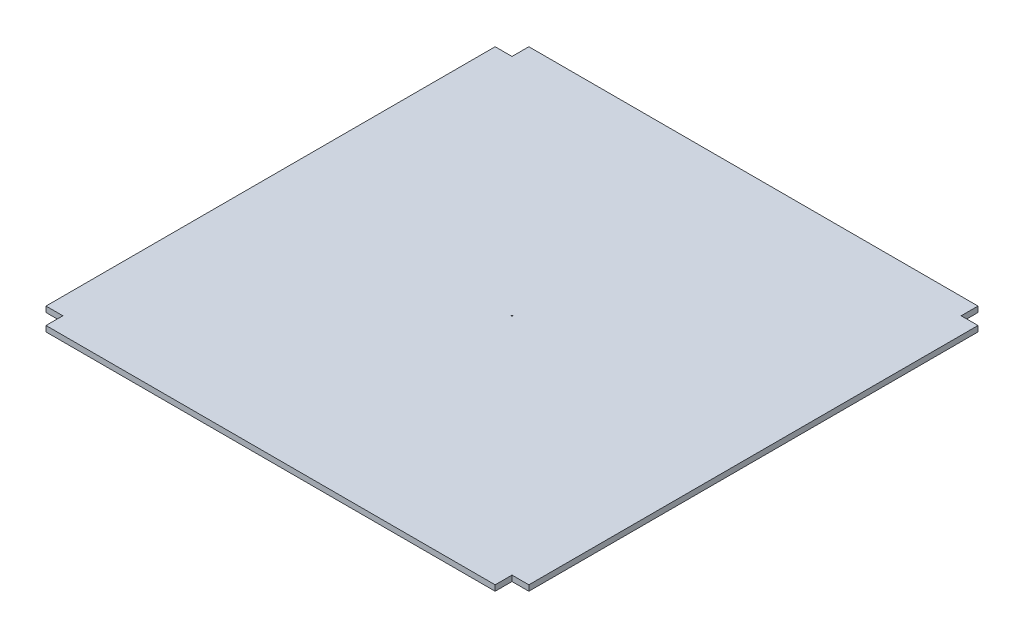
ISO-10303-21;
HEADER;
FILE_DESCRIPTION(('STEP AP214'),'2;1');
FILE_NAME('part.step','',(''),(''),'','','');
FILE_SCHEMA(('AUTOMOTIVE_DESIGN { 1 0 10303 214 1 1 1 1 }'));
ENDSEC;
DATA;
#1=APPLICATION_CONTEXT('core data for automotive mechanical design processes');
#2=APPLICATION_PROTOCOL_DEFINITION('international standard','automotive_design',2000,#1);
#3=PRODUCT_CONTEXT('',#1,'mechanical');
#4=PRODUCT('Part','Part','',(#3));
#5=PRODUCT_RELATED_PRODUCT_CATEGORY('part','',(#4));
#6=PRODUCT_DEFINITION_FORMATION('','',#4);
#7=PRODUCT_DEFINITION_CONTEXT('part definition',#1,'design');
#8=PRODUCT_DEFINITION('design','',#6,#7);
#9=PRODUCT_DEFINITION_SHAPE('','',#8);
#10=(LENGTH_UNIT() NAMED_UNIT(*) SI_UNIT(.MILLI.,.METRE.));
#11=(NAMED_UNIT(*) PLANE_ANGLE_UNIT() SI_UNIT($,.RADIAN.));
#12=(NAMED_UNIT(*) SI_UNIT($,.STERADIAN.) SOLID_ANGLE_UNIT());
#13=UNCERTAINTY_MEASURE_WITH_UNIT(LENGTH_MEASURE(1.E-05),#10,'distance_accuracy_value','');
#14=(GEOMETRIC_REPRESENTATION_CONTEXT(3) GLOBAL_UNCERTAINTY_ASSIGNED_CONTEXT((#13)) GLOBAL_UNIT_ASSIGNED_CONTEXT((#10,
#11,#12)) REPRESENTATION_CONTEXT('',''));
#15=CARTESIAN_POINT('',(0.,0.,0.));
#16=DIRECTION('',(0.,0.,1.));
#17=DIRECTION('',(1.,0.,0.));
#18=AXIS2_PLACEMENT_3D('',#15,#16,#17);
#19=CARTESIAN_POINT('',(0.,10.,430.));
#20=DIRECTION('',(0.,0.,-1.));
#21=DIRECTION('',(-1.,0.,0.));
#22=AXIS2_PLACEMENT_3D('',#19,#20,#21);
#23=PLANE('',#22);
#24=DIRECTION('',(1.,0.,0.));
#25=VECTOR('',#24,1.);
#26=CARTESIAN_POINT('',(0.,0.,430.));
#27=LINE('',#26,#25);
#28=CARTESIAN_POINT('',(-400.,0.,430.));
#29=VERTEX_POINT('',#28);
#30=CARTESIAN_POINT('',(400.,0.,430.));
#31=VERTEX_POINT('',#30);
#32=EDGE_CURVE('E165',#29,#31,#27,.T.);
#33=ORIENTED_EDGE('',*,*,#32,.T.);
#34=DIRECTION('',(0.,-1.,0.));
#35=VECTOR('',#34,1.);
#36=CARTESIAN_POINT('',(400.,10.,430.));
#37=LINE('',#36,#35);
#38=CARTESIAN_POINT('',(400.,10.,430.));
#39=VERTEX_POINT('',#38);
#40=EDGE_CURVE('E11',#39,#31,#37,.T.);
#41=ORIENTED_EDGE('',*,*,#40,.F.);
#42=DIRECTION('',(1.,0.,0.));
#43=VECTOR('',#42,1.);
#44=CARTESIAN_POINT('',(0.,10.,430.));
#45=LINE('',#44,#43);
#46=CARTESIAN_POINT('',(-400.,10.,430.));
#47=VERTEX_POINT('',#46);
#48=EDGE_CURVE('E210',#47,#39,#45,.T.);
#49=ORIENTED_EDGE('',*,*,#48,.F.);
#50=DIRECTION('',(0.,-1.,0.));
#51=VECTOR('',#50,1.);
#52=CARTESIAN_POINT('',(-400.,10.,430.));
#53=LINE('',#52,#51);
#54=EDGE_CURVE('E57',#47,#29,#53,.T.);
#55=ORIENTED_EDGE('',*,*,#54,.T.);
#56=EDGE_LOOP('',(#33,#41,#49,#55));
#57=FACE_BOUND('',#56,.T.);
#58=ADVANCED_FACE('F40',(#57),#23,.F.);
#59=CARTESIAN_POINT('',(400.,10.,0.));
#60=DIRECTION('',(-1.,0.,0.));
#61=DIRECTION('',(0.,0.,1.));
#62=AXIS2_PLACEMENT_3D('',#59,#60,#61);
#63=PLANE('',#62);
#64=DIRECTION('',(0.,0.,-1.));
#65=VECTOR('',#64,1.);
#66=CARTESIAN_POINT('',(400.,0.,0.));
#67=LINE('',#66,#65);
#68=CARTESIAN_POINT('',(400.,0.,400.));
#69=VERTEX_POINT('',#68);
#70=EDGE_CURVE('E168',#31,#69,#67,.T.);
#71=ORIENTED_EDGE('',*,*,#70,.T.);
#72=DIRECTION('',(0.,-1.,0.));
#73=VECTOR('',#72,1.);
#74=CARTESIAN_POINT('',(400.,10.,400.));
#75=LINE('',#74,#73);
#76=CARTESIAN_POINT('',(400.,10.,400.));
#77=VERTEX_POINT('',#76);
#78=EDGE_CURVE('E49',#77,#69,#75,.T.);
#79=ORIENTED_EDGE('',*,*,#78,.F.);
#80=DIRECTION('',(0.,0.,-1.));
#81=VECTOR('',#80,1.);
#82=CARTESIAN_POINT('',(400.,10.,0.));
#83=LINE('',#82,#81);
#84=EDGE_CURVE('E108',#39,#77,#83,.T.);
#85=ORIENTED_EDGE('',*,*,#84,.F.);
#86=ORIENTED_EDGE('',*,*,#40,.T.);
#87=EDGE_LOOP('',(#71,#79,#85,#86));
#88=FACE_BOUND('',#87,.T.);
#89=ADVANCED_FACE('F241',(#88),#63,.F.);
#90=CARTESIAN_POINT('',(-1.48029736616687E-12,10.,399.999999999998));
#91=DIRECTION('',(0.,0.,1.));
#92=DIRECTION('',(1.,0.,0.));
#93=AXIS2_PLACEMENT_3D('',#90,#91,#92);
#94=PLANE('',#93);
#95=DIRECTION('',(-1.,0.,0.));
#96=VECTOR('',#95,1.);
#97=CARTESIAN_POINT('',(-1.48029736616687E-12,0.,399.999999999998));
#98=LINE('',#97,#96);
#99=CARTESIAN_POINT('',(430.,0.,400.));
#100=VERTEX_POINT('',#99);
#101=EDGE_CURVE('E173',#100,#69,#98,.T.);
#102=ORIENTED_EDGE('',*,*,#101,.F.);
#103=DIRECTION('',(0.,-1.,0.));
#104=VECTOR('',#103,1.);
#105=CARTESIAN_POINT('',(430.,10.,400.));
#106=LINE('',#105,#104);
#107=CARTESIAN_POINT('',(430.,10.,400.));
#108=VERTEX_POINT('',#107);
#109=EDGE_CURVE('E232',#108,#100,#106,.T.);
#110=ORIENTED_EDGE('',*,*,#109,.F.);
#111=DIRECTION('',(-1.,0.,0.));
#112=VECTOR('',#111,1.);
#113=CARTESIAN_POINT('',(-1.48029736616687E-12,10.,399.999999999998));
#114=LINE('',#113,#112);
#115=EDGE_CURVE('E240',#108,#77,#114,.T.);
#116=ORIENTED_EDGE('',*,*,#115,.T.);
#117=ORIENTED_EDGE('',*,*,#78,.T.);
#118=EDGE_LOOP('',(#102,#110,#116,#117));
#119=FACE_BOUND('',#118,.T.);
#120=ADVANCED_FACE('F238',(#119),#94,.T.);
#121=CARTESIAN_POINT('',(430.,10.,0.));
#122=DIRECTION('',(1.,0.,0.));
#123=DIRECTION('',(0.,0.,-1.));
#124=AXIS2_PLACEMENT_3D('',#121,#122,#123);
#125=PLANE('',#124);
#126=DIRECTION('',(0.,0.,1.));
#127=VECTOR('',#126,1.);
#128=CARTESIAN_POINT('',(430.,0.,0.));
#129=LINE('',#128,#127);
#130=CARTESIAN_POINT('',(430.,0.,-400.));
#131=VERTEX_POINT('',#130);
#132=EDGE_CURVE('E177',#131,#100,#129,.T.);
#133=ORIENTED_EDGE('',*,*,#132,.F.);
#134=DIRECTION('',(0.,-1.,0.));
#135=VECTOR('',#134,1.);
#136=CARTESIAN_POINT('',(430.,10.,-400.));
#137=LINE('',#136,#135);
#138=CARTESIAN_POINT('',(430.,10.,-400.));
#139=VERTEX_POINT('',#138);
#140=EDGE_CURVE('E229',#139,#131,#137,.T.);
#141=ORIENTED_EDGE('',*,*,#140,.F.);
#142=DIRECTION('',(0.,0.,1.));
#143=VECTOR('',#142,1.);
#144=CARTESIAN_POINT('',(430.,10.,0.));
#145=LINE('',#144,#143);
#146=EDGE_CURVE('E252',#139,#108,#145,.T.);
#147=ORIENTED_EDGE('',*,*,#146,.T.);
#148=ORIENTED_EDGE('',*,*,#109,.T.);
#149=EDGE_LOOP('',(#133,#141,#147,#148));
#150=FACE_BOUND('',#149,.T.);
#151=ADVANCED_FACE('F248',(#150),#125,.T.);
#152=CARTESIAN_POINT('',(-1.48029736616687E-12,10.,-399.999999999998));
#153=DIRECTION('',(0.,0.,1.));
#154=DIRECTION('',(1.,0.,0.));
#155=AXIS2_PLACEMENT_3D('',#152,#153,#154);
#156=PLANE('',#155);
#157=DIRECTION('',(-1.,0.,0.));
#158=VECTOR('',#157,1.);
#159=CARTESIAN_POINT('',(-1.48029736616687E-12,0.,-399.999999999998));
#160=LINE('',#159,#158);
#161=CARTESIAN_POINT('',(400.,0.,-400.));
#162=VERTEX_POINT('',#161);
#163=EDGE_CURVE('E181',#131,#162,#160,.T.);
#164=ORIENTED_EDGE('',*,*,#163,.T.);
#165=DIRECTION('',(0.,-1.,0.));
#166=VECTOR('',#165,1.);
#167=CARTESIAN_POINT('',(400.,10.,-400.));
#168=LINE('',#167,#166);
#169=CARTESIAN_POINT('',(400.,10.,-400.));
#170=VERTEX_POINT('',#169);
#171=EDGE_CURVE('E226',#170,#162,#168,.T.);
#172=ORIENTED_EDGE('',*,*,#171,.F.);
#173=DIRECTION('',(-1.,0.,0.));
#174=VECTOR('',#173,1.);
#175=CARTESIAN_POINT('',(-1.48029736616687E-12,10.,-399.999999999998));
#176=LINE('',#175,#174);
#177=EDGE_CURVE('E257',#139,#170,#176,.T.);
#178=ORIENTED_EDGE('',*,*,#177,.F.);
#179=ORIENTED_EDGE('',*,*,#140,.T.);
#180=EDGE_LOOP('',(#164,#172,#178,#179));
#181=FACE_BOUND('',#180,.T.);
#182=ADVANCED_FACE('F378',(#181),#156,.F.);
#183=CARTESIAN_POINT('',(400.,10.,0.));
#184=DIRECTION('',(1.,0.,0.));
#185=DIRECTION('',(0.,0.,-1.));
#186=AXIS2_PLACEMENT_3D('',#183,#184,#185);
#187=PLANE('',#186);
#188=DIRECTION('',(0.,0.,1.));
#189=VECTOR('',#188,1.);
#190=CARTESIAN_POINT('',(400.,0.,0.));
#191=LINE('',#190,#189);
#192=CARTESIAN_POINT('',(400.,0.,-430.));
#193=VERTEX_POINT('',#192);
#194=EDGE_CURVE('E185',#193,#162,#191,.T.);
#195=ORIENTED_EDGE('',*,*,#194,.F.);
#196=DIRECTION('',(0.,-1.,0.));
#197=VECTOR('',#196,1.);
#198=CARTESIAN_POINT('',(400.,10.,-430.));
#199=LINE('',#198,#197);
#200=CARTESIAN_POINT('',(400.,10.,-430.));
#201=VERTEX_POINT('',#200);
#202=EDGE_CURVE('E223',#201,#193,#199,.T.);
#203=ORIENTED_EDGE('',*,*,#202,.F.);
#204=DIRECTION('',(0.,0.,1.));
#205=VECTOR('',#204,1.);
#206=CARTESIAN_POINT('',(400.,10.,0.));
#207=LINE('',#206,#205);
#208=EDGE_CURVE('E264',#201,#170,#207,.T.);
#209=ORIENTED_EDGE('',*,*,#208,.T.);
#210=ORIENTED_EDGE('',*,*,#171,.T.);
#211=EDGE_LOOP('',(#195,#203,#209,#210));
#212=FACE_BOUND('',#211,.T.);
#213=ADVANCED_FACE('F369',(#212),#187,.T.);
#214=CARTESIAN_POINT('',(0.,10.,-430.));
#215=DIRECTION('',(0.,0.,-1.));
#216=DIRECTION('',(-1.,0.,0.));
#217=AXIS2_PLACEMENT_3D('',#214,#215,#216);
#218=PLANE('',#217);
#219=DIRECTION('',(1.,0.,0.));
#220=VECTOR('',#219,1.);
#221=CARTESIAN_POINT('',(0.,0.,-430.));
#222=LINE('',#221,#220);
#223=CARTESIAN_POINT('',(-400.,0.,-430.));
#224=VERTEX_POINT('',#223);
#225=EDGE_CURVE('E189',#224,#193,#222,.T.);
#226=ORIENTED_EDGE('',*,*,#225,.F.);
#227=DIRECTION('',(0.,-1.,0.));
#228=VECTOR('',#227,1.);
#229=CARTESIAN_POINT('',(-400.,10.,-430.));
#230=LINE('',#229,#228);
#231=CARTESIAN_POINT('',(-400.,10.,-430.));
#232=VERTEX_POINT('',#231);
#233=EDGE_CURVE('E220',#232,#224,#230,.T.);
#234=ORIENTED_EDGE('',*,*,#233,.F.);
#235=DIRECTION('',(1.,0.,0.));
#236=VECTOR('',#235,1.);
#237=CARTESIAN_POINT('',(0.,10.,-430.));
#238=LINE('',#237,#236);
#239=EDGE_CURVE('E268',#232,#201,#238,.T.);
#240=ORIENTED_EDGE('',*,*,#239,.T.);
#241=ORIENTED_EDGE('',*,*,#202,.T.);
#242=EDGE_LOOP('',(#226,#234,#240,#241));
#243=FACE_BOUND('',#242,.T.);
#244=ADVANCED_FACE('F360',(#243),#218,.T.);
#245=CARTESIAN_POINT('',(-400.,10.,0.));
#246=DIRECTION('',(1.,0.,0.));
#247=DIRECTION('',(0.,0.,-1.));
#248=AXIS2_PLACEMENT_3D('',#245,#246,#247);
#249=PLANE('',#248);
#250=DIRECTION('',(0.,0.,1.));
#251=VECTOR('',#250,1.);
#252=CARTESIAN_POINT('',(-400.,0.,0.));
#253=LINE('',#252,#251);
#254=CARTESIAN_POINT('',(-400.,0.,-400.));
#255=VERTEX_POINT('',#254);
#256=EDGE_CURVE('E193',#224,#255,#253,.T.);
#257=ORIENTED_EDGE('',*,*,#256,.T.);
#258=DIRECTION('',(0.,-1.,0.));
#259=VECTOR('',#258,1.);
#260=CARTESIAN_POINT('',(-400.,10.,-400.));
#261=LINE('',#260,#259);
#262=CARTESIAN_POINT('',(-400.,10.,-400.));
#263=VERTEX_POINT('',#262);
#264=EDGE_CURVE('E217',#263,#255,#261,.T.);
#265=ORIENTED_EDGE('',*,*,#264,.F.);
#266=DIRECTION('',(0.,0.,1.));
#267=VECTOR('',#266,1.);
#268=CARTESIAN_POINT('',(-400.,10.,0.));
#269=LINE('',#268,#267);
#270=EDGE_CURVE('E272',#232,#263,#269,.T.);
#271=ORIENTED_EDGE('',*,*,#270,.F.);
#272=ORIENTED_EDGE('',*,*,#233,.T.);
#273=EDGE_LOOP('',(#257,#265,#271,#272));
#274=FACE_BOUND('',#273,.T.);
#275=ADVANCED_FACE('F352',(#274),#249,.F.);
#276=CARTESIAN_POINT('',(0.,10.,-400.));
#277=DIRECTION('',(0.,0.,-1.));
#278=DIRECTION('',(-1.,0.,0.));
#279=AXIS2_PLACEMENT_3D('',#276,#277,#278);
#280=PLANE('',#279);
#281=DIRECTION('',(1.,0.,0.));
#282=VECTOR('',#281,1.);
#283=CARTESIAN_POINT('',(0.,0.,-400.));
#284=LINE('',#283,#282);
#285=CARTESIAN_POINT('',(-430.,0.,-400.));
#286=VERTEX_POINT('',#285);
#287=EDGE_CURVE('E197',#286,#255,#284,.T.);
#288=ORIENTED_EDGE('',*,*,#287,.F.);
#289=DIRECTION('',(0.,-1.,0.));
#290=VECTOR('',#289,1.);
#291=CARTESIAN_POINT('',(-430.,10.,-400.));
#292=LINE('',#291,#290);
#293=CARTESIAN_POINT('',(-430.,10.,-400.));
#294=VERTEX_POINT('',#293);
#295=EDGE_CURVE('E155',#294,#286,#292,.T.);
#296=ORIENTED_EDGE('',*,*,#295,.F.);
#297=DIRECTION('',(1.,0.,0.));
#298=VECTOR('',#297,1.);
#299=CARTESIAN_POINT('',(0.,10.,-400.));
#300=LINE('',#299,#298);
#301=EDGE_CURVE('E143',#294,#263,#300,.T.);
#302=ORIENTED_EDGE('',*,*,#301,.T.);
#303=ORIENTED_EDGE('',*,*,#264,.T.);
#304=EDGE_LOOP('',(#288,#296,#302,#303));
#305=FACE_BOUND('',#304,.T.);
#306=ADVANCED_FACE('F277',(#305),#280,.T.);
#307=CARTESIAN_POINT('',(-430.,10.,0.));
#308=DIRECTION('',(1.,0.,0.));
#309=DIRECTION('',(0.,0.,-1.));
#310=AXIS2_PLACEMENT_3D('',#307,#308,#309);
#311=PLANE('',#310);
#312=DIRECTION('',(0.,0.,1.));
#313=VECTOR('',#312,1.);
#314=CARTESIAN_POINT('',(-430.,0.,0.));
#315=LINE('',#314,#313);
#316=CARTESIAN_POINT('',(-430.,0.,400.));
#317=VERTEX_POINT('',#316);
#318=EDGE_CURVE('E151',#286,#317,#315,.T.);
#319=ORIENTED_EDGE('',*,*,#318,.T.);
#320=DIRECTION('',(0.,-1.,0.));
#321=VECTOR('',#320,1.);
#322=CARTESIAN_POINT('',(-430.,10.,400.));
#323=LINE('',#322,#321);
#324=CARTESIAN_POINT('',(-430.,10.,400.));
#325=VERTEX_POINT('',#324);
#326=EDGE_CURVE('E148',#325,#317,#323,.T.);
#327=ORIENTED_EDGE('',*,*,#326,.F.);
#328=DIRECTION('',(0.,0.,1.));
#329=VECTOR('',#328,1.);
#330=CARTESIAN_POINT('',(-430.,10.,0.));
#331=LINE('',#330,#329);
#332=EDGE_CURVE('E136',#294,#325,#331,.T.);
#333=ORIENTED_EDGE('',*,*,#332,.F.);
#334=ORIENTED_EDGE('',*,*,#295,.T.);
#335=EDGE_LOOP('',(#319,#327,#333,#334));
#336=FACE_BOUND('',#335,.T.);
#337=ADVANCED_FACE('F149',(#336),#311,.F.);
#338=CARTESIAN_POINT('',(0.,10.,400.));
#339=DIRECTION('',(0.,0.,-1.));
#340=DIRECTION('',(-1.,0.,0.));
#341=AXIS2_PLACEMENT_3D('',#338,#339,#340);
#342=PLANE('',#341);
#343=DIRECTION('',(1.,0.,0.));
#344=VECTOR('',#343,1.);
#345=CARTESIAN_POINT('',(0.,0.,400.));
#346=LINE('',#345,#344);
#347=CARTESIAN_POINT('',(-400.,0.,400.));
#348=VERTEX_POINT('',#347);
#349=EDGE_CURVE('E203',#317,#348,#346,.T.);
#350=ORIENTED_EDGE('',*,*,#349,.T.);
#351=DIRECTION('',(0.,-1.,0.));
#352=VECTOR('',#351,1.);
#353=CARTESIAN_POINT('',(-400.,10.,400.));
#354=LINE('',#353,#352);
#355=CARTESIAN_POINT('',(-400.,10.,400.));
#356=VERTEX_POINT('',#355);
#357=EDGE_CURVE('E96',#356,#348,#354,.T.);
#358=ORIENTED_EDGE('',*,*,#357,.F.);
#359=DIRECTION('',(1.,0.,0.));
#360=VECTOR('',#359,1.);
#361=CARTESIAN_POINT('',(0.,10.,400.));
#362=LINE('',#361,#360);
#363=EDGE_CURVE('E141',#325,#356,#362,.T.);
#364=ORIENTED_EDGE('',*,*,#363,.F.);
#365=ORIENTED_EDGE('',*,*,#326,.T.);
#366=EDGE_LOOP('',(#350,#358,#364,#365));
#367=FACE_BOUND('',#366,.T.);
#368=ADVANCED_FACE('F157',(#367),#342,.F.);
#369=CARTESIAN_POINT('',(-400.,10.,0.));
#370=DIRECTION('',(-1.,0.,0.));
#371=DIRECTION('',(0.,0.,1.));
#372=AXIS2_PLACEMENT_3D('',#369,#370,#371);
#373=PLANE('',#372);
#374=DIRECTION('',(0.,0.,-1.));
#375=VECTOR('',#374,1.);
#376=CARTESIAN_POINT('',(-400.,0.,0.));
#377=LINE('',#376,#375);
#378=EDGE_CURVE('E206',#29,#348,#377,.T.);
#379=ORIENTED_EDGE('',*,*,#378,.F.);
#380=ORIENTED_EDGE('',*,*,#54,.F.);
#381=DIRECTION('',(0.,0.,-1.));
#382=VECTOR('',#381,1.);
#383=CARTESIAN_POINT('',(-400.,10.,0.));
#384=LINE('',#383,#382);
#385=EDGE_CURVE('E159',#47,#356,#384,.T.);
#386=ORIENTED_EDGE('',*,*,#385,.T.);
#387=ORIENTED_EDGE('',*,*,#357,.T.);
#388=EDGE_LOOP('',(#379,#380,#386,#387));
#389=FACE_BOUND('',#388,.T.);
#390=ADVANCED_FACE('F280',(#389),#373,.T.);
#391=CARTESIAN_POINT('',(0.,10.,0.));
#392=DIRECTION('',(0.,1.,0.));
#393=DIRECTION('',(0.,0.,1.));
#394=AXIS2_PLACEMENT_3D('',#391,#392,#393);
#395=PLANE('',#394);
#396=CARTESIAN_POINT('',(0.,10.,0.));
#397=DIRECTION('',(0.,1.,0.));
#398=DIRECTION('',(0.,0.,1.));
#399=AXIS2_PLACEMENT_3D('',#396,#397,#398);
#400=CIRCLE('',#399,1.);
#401=CARTESIAN_POINT('',(0.,10.,1.));
#402=VERTEX_POINT('',#401);
#403=EDGE_CURVE('E169',#402,#402,#400,.T.);
#404=ORIENTED_EDGE('',*,*,#403,.F.);
#405=EDGE_LOOP('',(#404));
#406=FACE_BOUND('',#405,.T.);
#407=ORIENTED_EDGE('',*,*,#48,.T.);
#408=ORIENTED_EDGE('',*,*,#84,.T.);
#409=ORIENTED_EDGE('',*,*,#115,.F.);
#410=ORIENTED_EDGE('',*,*,#146,.F.);
#411=ORIENTED_EDGE('',*,*,#177,.T.);
#412=ORIENTED_EDGE('',*,*,#208,.F.);
#413=ORIENTED_EDGE('',*,*,#239,.F.);
#414=ORIENTED_EDGE('',*,*,#270,.T.);
#415=ORIENTED_EDGE('',*,*,#301,.F.);
#416=ORIENTED_EDGE('',*,*,#332,.T.);
#417=ORIENTED_EDGE('',*,*,#363,.T.);
#418=ORIENTED_EDGE('',*,*,#385,.F.);
#419=EDGE_LOOP('',(#407,#408,#409,#410,#411,#412,#413,#414,#415,#416,#417,#418));
#420=FACE_BOUND('',#419,.T.);
#421=ADVANCED_FACE('F138',(#406,#420),#395,.T.);
#422=CARTESIAN_POINT('',(0.,0.,0.));
#423=DIRECTION('',(0.,1.,0.));
#424=DIRECTION('',(0.,0.,1.));
#425=AXIS2_PLACEMENT_3D('',#422,#423,#424);
#426=PLANE('',#425);
#427=CARTESIAN_POINT('',(0.,0.,0.));
#428=DIRECTION('',(0.,1.,0.));
#429=DIRECTION('',(0.,0.,1.));
#430=AXIS2_PLACEMENT_3D('',#427,#428,#429);
#431=CIRCLE('',#430,1.);
#432=CARTESIAN_POINT('',(0.,0.,1.));
#433=VERTEX_POINT('',#432);
#434=EDGE_CURVE('E301',#433,#433,#431,.T.);
#435=ORIENTED_EDGE('',*,*,#434,.T.);
#436=EDGE_LOOP('',(#435));
#437=FACE_BOUND('',#436,.T.);
#438=ORIENTED_EDGE('',*,*,#32,.F.);
#439=ORIENTED_EDGE('',*,*,#378,.T.);
#440=ORIENTED_EDGE('',*,*,#349,.F.);
#441=ORIENTED_EDGE('',*,*,#318,.F.);
#442=ORIENTED_EDGE('',*,*,#287,.T.);
#443=ORIENTED_EDGE('',*,*,#256,.F.);
#444=ORIENTED_EDGE('',*,*,#225,.T.);
#445=ORIENTED_EDGE('',*,*,#194,.T.);
#446=ORIENTED_EDGE('',*,*,#163,.F.);
#447=ORIENTED_EDGE('',*,*,#132,.T.);
#448=ORIENTED_EDGE('',*,*,#101,.T.);
#449=ORIENTED_EDGE('',*,*,#70,.F.);
#450=EDGE_LOOP('',(#438,#439,#440,#441,#442,#443,#444,#445,#446,#447,#448,#449));
#451=FACE_BOUND('',#450,.T.);
#452=ADVANCED_FACE('F244',(#437,#451),#426,.F.);
#453=CARTESIAN_POINT('',(0.,0.,0.));
#454=DIRECTION('',(0.,1.,0.));
#455=DIRECTION('',(0.,0.,1.));
#456=AXIS2_PLACEMENT_3D('',#453,#454,#455);
#457=CYLINDRICAL_SURFACE('',#456,1.);
#458=ORIENTED_EDGE('',*,*,#403,.T.);
#459=EDGE_LOOP('',(#458));
#460=FACE_BOUND('',#459,.T.);
#461=ORIENTED_EDGE('',*,*,#434,.F.);
#462=EDGE_LOOP('',(#461));
#463=FACE_BOUND('',#462,.T.);
#464=ADVANCED_FACE('F307',(#460,#463),#457,.F.);
#465=CLOSED_SHELL('',(#58,#89,#120,#151,#182,#213,#244,#275,#306,#337,#368,#390,#421,#452,#464));
#466=MANIFOLD_SOLID_BREP('B2',#465);
#467=ADVANCED_BREP_SHAPE_REPRESENTATION('',(#18,#466),#14);
#468=SHAPE_DEFINITION_REPRESENTATION(#9,#467);
ENDSEC;
END-ISO-10303-21;
